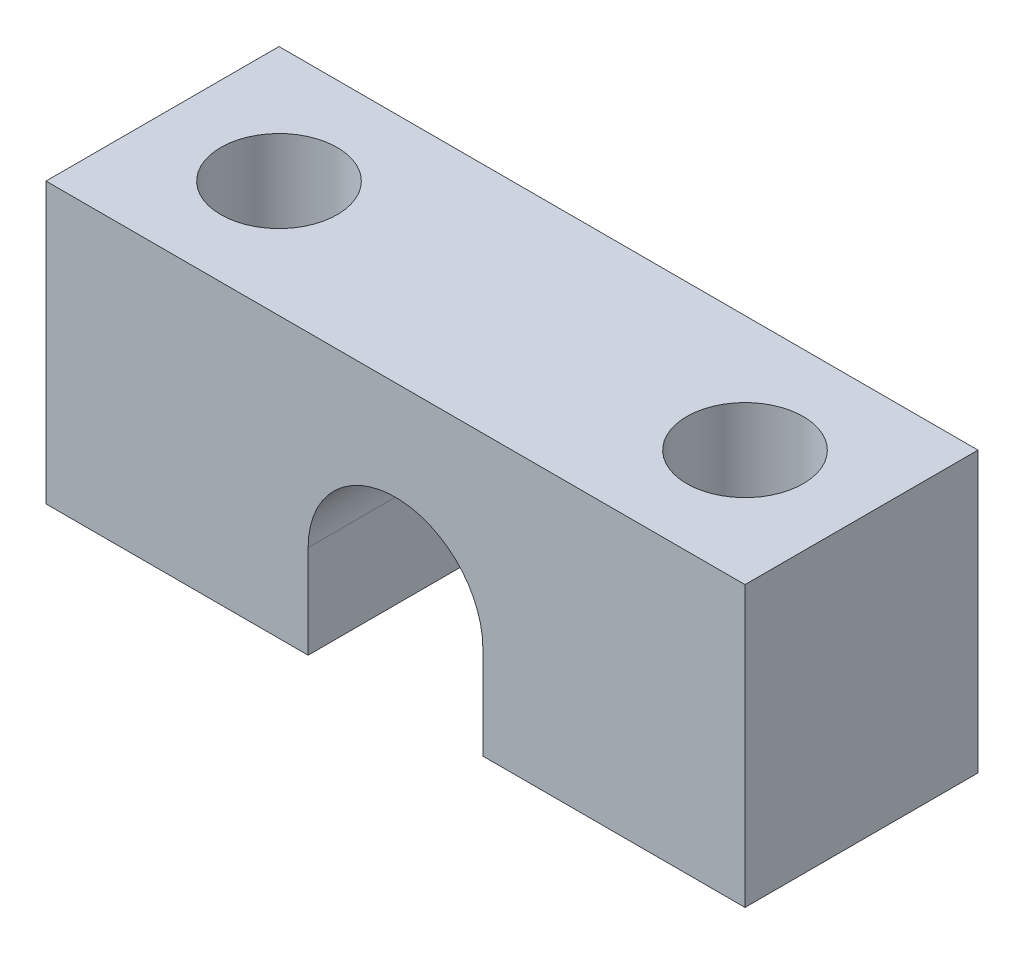
ISO-10303-21;
HEADER;
FILE_DESCRIPTION(('STEP AP214'),'2;1');
FILE_NAME('part.step','',(''),(''),'','','');
FILE_SCHEMA(('AUTOMOTIVE_DESIGN { 1 0 10303 214 1 1 1 1 }'));
ENDSEC;
DATA;
#1=APPLICATION_CONTEXT('core data for automotive mechanical design processes');
#2=APPLICATION_PROTOCOL_DEFINITION('international standard','automotive_design',2000,#1);
#3=PRODUCT_CONTEXT('',#1,'mechanical');
#4=PRODUCT('Part','Part','',(#3));
#5=PRODUCT_RELATED_PRODUCT_CATEGORY('part','',(#4));
#6=PRODUCT_DEFINITION_FORMATION('','',#4);
#7=PRODUCT_DEFINITION_CONTEXT('part definition',#1,'design');
#8=PRODUCT_DEFINITION('design','',#6,#7);
#9=PRODUCT_DEFINITION_SHAPE('','',#8);
#10=(LENGTH_UNIT() NAMED_UNIT(*) SI_UNIT(.MILLI.,.METRE.));
#11=(NAMED_UNIT(*) PLANE_ANGLE_UNIT() SI_UNIT($,.RADIAN.));
#12=(NAMED_UNIT(*) SI_UNIT($,.STERADIAN.) SOLID_ANGLE_UNIT());
#13=UNCERTAINTY_MEASURE_WITH_UNIT(LENGTH_MEASURE(1.E-05),#10,'distance_accuracy_value','');
#14=(GEOMETRIC_REPRESENTATION_CONTEXT(3) GLOBAL_UNCERTAINTY_ASSIGNED_CONTEXT((#13)) GLOBAL_UNIT_ASSIGNED_CONTEXT((#10,
#11,#12)) REPRESENTATION_CONTEXT('',''));
#15=CARTESIAN_POINT('',(0.,0.,0.));
#16=DIRECTION('',(0.,0.,1.));
#17=DIRECTION('',(1.,0.,0.));
#18=AXIS2_PLACEMENT_3D('',#15,#16,#17);
#19=CARTESIAN_POINT('',(-20.,0.,0.));
#20=DIRECTION('',(0.,1.,0.));
#21=DIRECTION('',(0.,0.,1.));
#22=AXIS2_PLACEMENT_3D('',#19,#20,#21);
#23=CYLINDRICAL_SURFACE('',#22,5.);
#24=CARTESIAN_POINT('',(-20.,24.,0.));
#25=DIRECTION('',(0.,1.,0.));
#26=DIRECTION('',(0.,0.,1.));
#27=AXIS2_PLACEMENT_3D('',#24,#25,#26);
#28=CIRCLE('',#27,5.);
#29=CARTESIAN_POINT('',(-20.,24.,5.));
#30=VERTEX_POINT('',#29);
#31=EDGE_CURVE('E147',#30,#30,#28,.F.);
#32=ORIENTED_EDGE('',*,*,#31,.F.);
#33=EDGE_LOOP('',(#32));
#34=FACE_BOUND('',#33,.T.);
#35=CARTESIAN_POINT('',(-20.,0.,0.));
#36=DIRECTION('',(0.,1.,0.));
#37=DIRECTION('',(0.,0.,1.));
#38=AXIS2_PLACEMENT_3D('',#35,#36,#37);
#39=CIRCLE('',#38,5.);
#40=CARTESIAN_POINT('',(-20.,0.,5.));
#41=VERTEX_POINT('',#40);
#42=EDGE_CURVE('E132',#41,#41,#39,.F.);
#43=ORIENTED_EDGE('',*,*,#42,.T.);
#44=EDGE_LOOP('',(#43));
#45=FACE_BOUND('',#44,.T.);
#46=ADVANCED_FACE('F17',(#34,#45),#23,.F.);
#47=CARTESIAN_POINT('',(20.,0.,0.));
#48=DIRECTION('',(0.,1.,0.));
#49=DIRECTION('',(0.,0.,1.));
#50=AXIS2_PLACEMENT_3D('',#47,#48,#49);
#51=CYLINDRICAL_SURFACE('',#50,5.);
#52=CARTESIAN_POINT('',(20.,24.,0.));
#53=DIRECTION('',(0.,1.,0.));
#54=DIRECTION('',(0.,0.,1.));
#55=AXIS2_PLACEMENT_3D('',#52,#53,#54);
#56=CIRCLE('',#55,5.);
#57=CARTESIAN_POINT('',(20.,24.,5.));
#58=VERTEX_POINT('',#57);
#59=EDGE_CURVE('E144',#58,#58,#56,.F.);
#60=ORIENTED_EDGE('',*,*,#59,.F.);
#61=EDGE_LOOP('',(#60));
#62=FACE_BOUND('',#61,.T.);
#63=CARTESIAN_POINT('',(20.,0.,0.));
#64=DIRECTION('',(0.,1.,0.));
#65=DIRECTION('',(0.,0.,1.));
#66=AXIS2_PLACEMENT_3D('',#63,#64,#65);
#67=CIRCLE('',#66,5.);
#68=CARTESIAN_POINT('',(20.,0.,5.));
#69=VERTEX_POINT('',#68);
#70=EDGE_CURVE('E141',#69,#69,#67,.F.);
#71=ORIENTED_EDGE('',*,*,#70,.T.);
#72=EDGE_LOOP('',(#71));
#73=FACE_BOUND('',#72,.T.);
#74=ADVANCED_FACE('F244',(#62,#73),#51,.F.);
#75=CARTESIAN_POINT('',(-30.,0.,10.));
#76=DIRECTION('',(0.,0.,1.));
#77=DIRECTION('',(1.,0.,0.));
#78=AXIS2_PLACEMENT_3D('',#75,#76,#77);
#79=PLANE('',#78);
#80=CARTESIAN_POINT('',(0.,8.,10.));
#81=DIRECTION('',(0.,0.,1.));
#82=DIRECTION('',(1.,0.,0.));
#83=AXIS2_PLACEMENT_3D('',#80,#81,#82);
#84=CIRCLE('',#83,7.5);
#85=CARTESIAN_POINT('',(-7.5,8.,10.));
#86=VERTEX_POINT('',#85);
#87=CARTESIAN_POINT('',(7.5,8.,10.));
#88=VERTEX_POINT('',#87);
#89=EDGE_CURVE('E20',#86,#88,#84,.F.);
#90=ORIENTED_EDGE('',*,*,#89,.T.);
#91=DIRECTION('',(0.,1.,0.));
#92=VECTOR('',#91,1.);
#93=CARTESIAN_POINT('',(7.5,0.,10.));
#94=LINE('',#93,#92);
#95=CARTESIAN_POINT('',(7.5,0.,10.));
#96=VERTEX_POINT('',#95);
#97=EDGE_CURVE('E107',#88,#96,#94,.F.);
#98=ORIENTED_EDGE('',*,*,#97,.T.);
#99=DIRECTION('',(1.,0.,0.));
#100=VECTOR('',#99,1.);
#101=CARTESIAN_POINT('',(0.,0.,10.));
#102=LINE('',#101,#100);
#103=CARTESIAN_POINT('',(30.,0.,10.));
#104=VERTEX_POINT('',#103);
#105=EDGE_CURVE('E112',#96,#104,#102,.T.);
#106=ORIENTED_EDGE('',*,*,#105,.T.);
#107=DIRECTION('',(0.,1.,0.));
#108=VECTOR('',#107,1.);
#109=CARTESIAN_POINT('',(30.,0.,10.));
#110=LINE('',#109,#108);
#111=CARTESIAN_POINT('',(30.,24.,10.));
#112=VERTEX_POINT('',#111);
#113=EDGE_CURVE('E115',#112,#104,#110,.F.);
#114=ORIENTED_EDGE('',*,*,#113,.F.);
#115=DIRECTION('',(1.,0.,0.));
#116=VECTOR('',#115,1.);
#117=CARTESIAN_POINT('',(0.,24.,10.));
#118=LINE('',#117,#116);
#119=CARTESIAN_POINT('',(-30.,24.,10.));
#120=VERTEX_POINT('',#119);
#121=EDGE_CURVE('E123',#120,#112,#118,.T.);
#122=ORIENTED_EDGE('',*,*,#121,.F.);
#123=DIRECTION('',(0.,1.,0.));
#124=VECTOR('',#123,1.);
#125=CARTESIAN_POINT('',(-30.,0.,10.));
#126=LINE('',#125,#124);
#127=CARTESIAN_POINT('',(-30.,0.,10.));
#128=VERTEX_POINT('',#127);
#129=EDGE_CURVE('E129',#128,#120,#126,.T.);
#130=ORIENTED_EDGE('',*,*,#129,.F.);
#131=DIRECTION('',(1.,0.,0.));
#132=VECTOR('',#131,1.);
#133=CARTESIAN_POINT('',(0.,0.,10.));
#134=LINE('',#133,#132);
#135=CARTESIAN_POINT('',(-7.5,0.,10.));
#136=VERTEX_POINT('',#135);
#137=EDGE_CURVE('E85',#128,#136,#134,.T.);
#138=ORIENTED_EDGE('',*,*,#137,.T.);
#139=DIRECTION('',(0.,1.,0.));
#140=VECTOR('',#139,1.);
#141=CARTESIAN_POINT('',(-7.5,8.,10.));
#142=LINE('',#141,#140);
#143=EDGE_CURVE('E79',#136,#86,#142,.T.);
#144=ORIENTED_EDGE('',*,*,#143,.T.);
#145=EDGE_LOOP('',(#90,#98,#106,#114,#122,#130,#138,#144));
#146=FACE_BOUND('',#145,.T.);
#147=ADVANCED_FACE('F81',(#146),#79,.T.);
#148=CARTESIAN_POINT('',(0.,8.,10.));
#149=DIRECTION('',(0.,0.,1.));
#150=DIRECTION('',(1.,0.,0.));
#151=AXIS2_PLACEMENT_3D('',#148,#149,#150);
#152=CYLINDRICAL_SURFACE('',#151,7.5);
#153=CARTESIAN_POINT('',(0.,8.,-10.));
#154=DIRECTION('',(0.,0.,1.));
#155=DIRECTION('',(1.,0.,0.));
#156=AXIS2_PLACEMENT_3D('',#153,#154,#155);
#157=CIRCLE('',#156,7.5);
#158=CARTESIAN_POINT('',(7.5,8.,-10.));
#159=VERTEX_POINT('',#158);
#160=CARTESIAN_POINT('',(-7.5,8.,-10.));
#161=VERTEX_POINT('',#160);
#162=EDGE_CURVE('E109',#159,#161,#157,.T.);
#163=ORIENTED_EDGE('',*,*,#162,.F.);
#164=DIRECTION('',(0.,0.,-1.));
#165=VECTOR('',#164,1.);
#166=CARTESIAN_POINT('',(7.5,8.,10.));
#167=LINE('',#166,#165);
#168=EDGE_CURVE('E95',#159,#88,#167,.F.);
#169=ORIENTED_EDGE('',*,*,#168,.T.);
#170=ORIENTED_EDGE('',*,*,#89,.F.);
#171=DIRECTION('',(0.,0.,1.));
#172=VECTOR('',#171,1.);
#173=CARTESIAN_POINT('',(-7.5,8.,10.));
#174=LINE('',#173,#172);
#175=EDGE_CURVE('E89',#86,#161,#174,.F.);
#176=ORIENTED_EDGE('',*,*,#175,.T.);
#177=EDGE_LOOP('',(#163,#169,#170,#176));
#178=FACE_BOUND('',#177,.T.);
#179=ADVANCED_FACE('F92',(#178),#152,.F.);
#180=CARTESIAN_POINT('',(-7.5,8.,10.));
#181=DIRECTION('',(-1.,0.,0.));
#182=DIRECTION('',(0.,0.,1.));
#183=AXIS2_PLACEMENT_3D('',#180,#181,#182);
#184=PLANE('',#183);
#185=ORIENTED_EDGE('',*,*,#175,.F.);
#186=ORIENTED_EDGE('',*,*,#143,.F.);
#187=DIRECTION('',(0.,0.,1.));
#188=VECTOR('',#187,1.);
#189=CARTESIAN_POINT('',(-7.5,0.,0.));
#190=LINE('',#189,#188);
#191=CARTESIAN_POINT('',(-7.5,0.,-10.));
#192=VERTEX_POINT('',#191);
#193=EDGE_CURVE('E101',#136,#192,#190,.F.);
#194=ORIENTED_EDGE('',*,*,#193,.T.);
#195=DIRECTION('',(0.,1.,0.));
#196=VECTOR('',#195,1.);
#197=CARTESIAN_POINT('',(-7.5,0.,-10.));
#198=LINE('',#197,#196);
#199=EDGE_CURVE('E99',#161,#192,#198,.F.);
#200=ORIENTED_EDGE('',*,*,#199,.F.);
#201=EDGE_LOOP('',(#185,#186,#194,#200));
#202=FACE_BOUND('',#201,.T.);
#203=ADVANCED_FACE('F97',(#202),#184,.F.);
#204=CARTESIAN_POINT('',(0.,0.,0.));
#205=DIRECTION('',(0.,1.,0.));
#206=DIRECTION('',(0.,0.,1.));
#207=AXIS2_PLACEMENT_3D('',#204,#205,#206);
#208=PLANE('',#207);
#209=ORIENTED_EDGE('',*,*,#42,.F.);
#210=EDGE_LOOP('',(#209));
#211=FACE_BOUND('',#210,.T.);
#212=DIRECTION('',(0.,0.,1.));
#213=VECTOR('',#212,1.);
#214=CARTESIAN_POINT('',(-30.,0.,-10.));
#215=LINE('',#214,#213);
#216=CARTESIAN_POINT('',(-30.,0.,-10.));
#217=VERTEX_POINT('',#216);
#218=EDGE_CURVE('E126',#217,#128,#215,.T.);
#219=ORIENTED_EDGE('',*,*,#218,.F.);
#220=DIRECTION('',(-1.,0.,0.));
#221=VECTOR('',#220,1.);
#222=CARTESIAN_POINT('',(30.,0.,-10.));
#223=LINE('',#222,#221);
#224=EDGE_CURVE('E162',#192,#217,#223,.T.);
#225=ORIENTED_EDGE('',*,*,#224,.F.);
#226=ORIENTED_EDGE('',*,*,#193,.F.);
#227=ORIENTED_EDGE('',*,*,#137,.F.);
#228=EDGE_LOOP('',(#219,#225,#226,#227));
#229=FACE_BOUND('',#228,.T.);
#230=ADVANCED_FACE('F153',(#211,#229),#208,.F.);
#231=CARTESIAN_POINT('',(-30.,0.,-10.));
#232=DIRECTION('',(-1.,0.,0.));
#233=DIRECTION('',(0.,0.,1.));
#234=AXIS2_PLACEMENT_3D('',#231,#232,#233);
#235=PLANE('',#234);
#236=DIRECTION('',(0.,1.,0.));
#237=VECTOR('',#236,1.);
#238=CARTESIAN_POINT('',(-30.,0.,-10.));
#239=LINE('',#238,#237);
#240=CARTESIAN_POINT('',(-30.,24.,-10.));
#241=VERTEX_POINT('',#240);
#242=EDGE_CURVE('E166',#217,#241,#239,.T.);
#243=ORIENTED_EDGE('',*,*,#242,.F.);
#244=ORIENTED_EDGE('',*,*,#218,.T.);
#245=ORIENTED_EDGE('',*,*,#129,.T.);
#246=DIRECTION('',(0.,0.,1.));
#247=VECTOR('',#246,1.);
#248=CARTESIAN_POINT('',(-30.,24.,0.));
#249=LINE('',#248,#247);
#250=EDGE_CURVE('E125',#241,#120,#249,.T.);
#251=ORIENTED_EDGE('',*,*,#250,.F.);
#252=EDGE_LOOP('',(#243,#244,#245,#251));
#253=FACE_BOUND('',#252,.T.);
#254=ADVANCED_FACE('F156',(#253),#235,.T.);
#255=CARTESIAN_POINT('',(0.,24.,0.));
#256=DIRECTION('',(0.,1.,0.));
#257=DIRECTION('',(0.,0.,1.));
#258=AXIS2_PLACEMENT_3D('',#255,#256,#257);
#259=PLANE('',#258);
#260=ORIENTED_EDGE('',*,*,#59,.T.);
#261=EDGE_LOOP('',(#260));
#262=FACE_BOUND('',#261,.T.);
#263=ORIENTED_EDGE('',*,*,#31,.T.);
#264=EDGE_LOOP('',(#263));
#265=FACE_BOUND('',#264,.T.);
#266=DIRECTION('',(-1.,0.,0.));
#267=VECTOR('',#266,1.);
#268=CARTESIAN_POINT('',(30.,24.,-10.));
#269=LINE('',#268,#267);
#270=CARTESIAN_POINT('',(30.,24.,-10.));
#271=VERTEX_POINT('',#270);
#272=EDGE_CURVE('E171',#241,#271,#269,.F.);
#273=ORIENTED_EDGE('',*,*,#272,.F.);
#274=ORIENTED_EDGE('',*,*,#250,.T.);
#275=ORIENTED_EDGE('',*,*,#121,.T.);
#276=DIRECTION('',(0.,0.,-1.));
#277=VECTOR('',#276,1.);
#278=CARTESIAN_POINT('',(30.,24.,10.));
#279=LINE('',#278,#277);
#280=EDGE_CURVE('E120',#271,#112,#279,.F.);
#281=ORIENTED_EDGE('',*,*,#280,.F.);
#282=EDGE_LOOP('',(#273,#274,#275,#281));
#283=FACE_BOUND('',#282,.T.);
#284=ADVANCED_FACE('F233',(#262,#265,#283),#259,.T.);
#285=CARTESIAN_POINT('',(30.,0.,10.));
#286=DIRECTION('',(1.,0.,0.));
#287=DIRECTION('',(0.,0.,-1.));
#288=AXIS2_PLACEMENT_3D('',#285,#286,#287);
#289=PLANE('',#288);
#290=ORIENTED_EDGE('',*,*,#113,.T.);
#291=DIRECTION('',(0.,0.,1.));
#292=VECTOR('',#291,1.);
#293=CARTESIAN_POINT('',(30.,0.,0.));
#294=LINE('',#293,#292);
#295=CARTESIAN_POINT('',(30.,0.,-10.));
#296=VERTEX_POINT('',#295);
#297=EDGE_CURVE('E114',#104,#296,#294,.F.);
#298=ORIENTED_EDGE('',*,*,#297,.T.);
#299=DIRECTION('',(0.,1.,0.));
#300=VECTOR('',#299,1.);
#301=CARTESIAN_POINT('',(30.,0.,-10.));
#302=LINE('',#301,#300);
#303=EDGE_CURVE('E190',#271,#296,#302,.F.);
#304=ORIENTED_EDGE('',*,*,#303,.F.);
#305=ORIENTED_EDGE('',*,*,#280,.T.);
#306=EDGE_LOOP('',(#290,#298,#304,#305));
#307=FACE_BOUND('',#306,.T.);
#308=ADVANCED_FACE('F216',(#307),#289,.T.);
#309=CARTESIAN_POINT('',(0.,0.,0.));
#310=DIRECTION('',(0.,1.,0.));
#311=DIRECTION('',(0.,0.,1.));
#312=AXIS2_PLACEMENT_3D('',#309,#310,#311);
#313=PLANE('',#312);
#314=ORIENTED_EDGE('',*,*,#70,.F.);
#315=EDGE_LOOP('',(#314));
#316=FACE_BOUND('',#315,.T.);
#317=ORIENTED_EDGE('',*,*,#297,.F.);
#318=ORIENTED_EDGE('',*,*,#105,.F.);
#319=DIRECTION('',(0.,0.,-1.));
#320=VECTOR('',#319,1.);
#321=CARTESIAN_POINT('',(7.5,0.,10.));
#322=LINE('',#321,#320);
#323=CARTESIAN_POINT('',(7.5,0.,-10.));
#324=VERTEX_POINT('',#323);
#325=EDGE_CURVE('E35',#96,#324,#322,.T.);
#326=ORIENTED_EDGE('',*,*,#325,.T.);
#327=DIRECTION('',(-1.,0.,0.));
#328=VECTOR('',#327,1.);
#329=CARTESIAN_POINT('',(30.,0.,-10.));
#330=LINE('',#329,#328);
#331=EDGE_CURVE('E26',#296,#324,#330,.T.);
#332=ORIENTED_EDGE('',*,*,#331,.F.);
#333=EDGE_LOOP('',(#317,#318,#326,#332));
#334=FACE_BOUND('',#333,.T.);
#335=ADVANCED_FACE('F214',(#316,#334),#313,.F.);
#336=CARTESIAN_POINT('',(7.5,0.,10.));
#337=DIRECTION('',(1.,0.,0.));
#338=DIRECTION('',(0.,0.,-1.));
#339=AXIS2_PLACEMENT_3D('',#336,#337,#338);
#340=PLANE('',#339);
#341=ORIENTED_EDGE('',*,*,#168,.F.);
#342=DIRECTION('',(0.,1.,0.));
#343=VECTOR('',#342,1.);
#344=CARTESIAN_POINT('',(7.5,0.,-10.));
#345=LINE('',#344,#343);
#346=EDGE_CURVE('E11',#324,#159,#345,.T.);
#347=ORIENTED_EDGE('',*,*,#346,.F.);
#348=ORIENTED_EDGE('',*,*,#325,.F.);
#349=ORIENTED_EDGE('',*,*,#97,.F.);
#350=EDGE_LOOP('',(#341,#347,#348,#349));
#351=FACE_BOUND('',#350,.T.);
#352=ADVANCED_FACE('F219',(#351),#340,.F.);
#353=CARTESIAN_POINT('',(30.,0.,-10.));
#354=DIRECTION('',(0.,0.,-1.));
#355=DIRECTION('',(-1.,0.,0.));
#356=AXIS2_PLACEMENT_3D('',#353,#354,#355);
#357=PLANE('',#356);
#358=ORIENTED_EDGE('',*,*,#331,.T.);
#359=ORIENTED_EDGE('',*,*,#346,.T.);
#360=ORIENTED_EDGE('',*,*,#162,.T.);
#361=ORIENTED_EDGE('',*,*,#199,.T.);
#362=ORIENTED_EDGE('',*,*,#224,.T.);
#363=ORIENTED_EDGE('',*,*,#242,.T.);
#364=ORIENTED_EDGE('',*,*,#272,.T.);
#365=ORIENTED_EDGE('',*,*,#303,.T.);
#366=EDGE_LOOP('',(#358,#359,#360,#361,#362,#363,#364,#365));
#367=FACE_BOUND('',#366,.T.);
#368=ADVANCED_FACE('F174',(#367),#357,.T.);
#369=CLOSED_SHELL('',(#46,#74,#147,#179,#203,#230,#254,#284,#308,#335,#352,#368));
#370=MANIFOLD_SOLID_BREP('B1',#369);
#371=ADVANCED_BREP_SHAPE_REPRESENTATION('',(#18,#370),#14);
#372=SHAPE_DEFINITION_REPRESENTATION(#9,#371);
ENDSEC;
END-ISO-10303-21;
